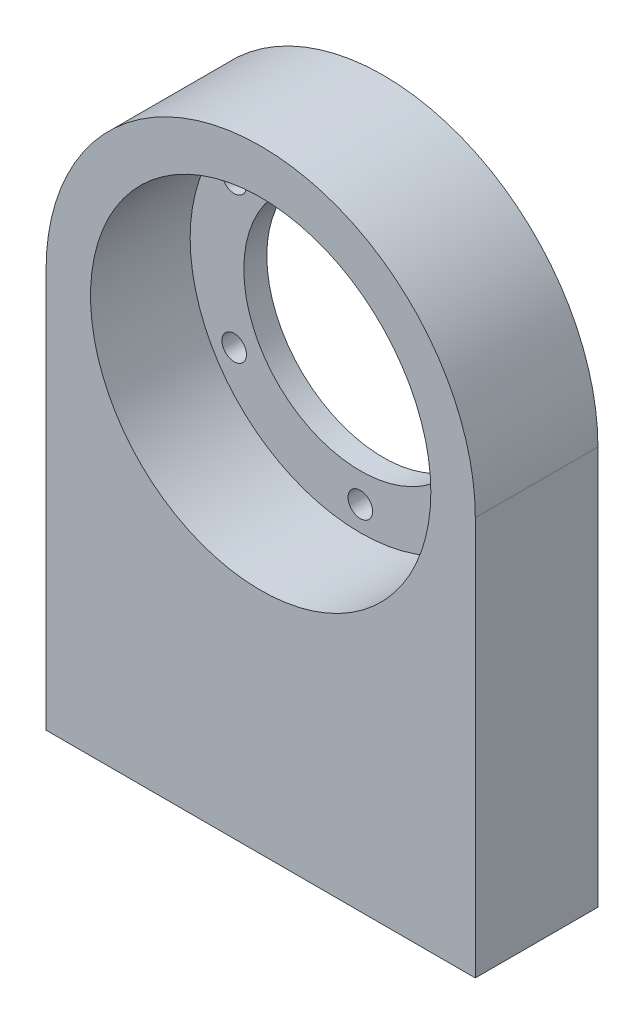
ISO-10303-21;
HEADER;
FILE_DESCRIPTION(('STEP AP214'),'2;1');
FILE_NAME('part.step','',(''),(''),'','','');
FILE_SCHEMA(('AUTOMOTIVE_DESIGN { 1 0 10303 214 1 1 1 1 }'));
ENDSEC;
DATA;
#1=APPLICATION_CONTEXT('core data for automotive mechanical design processes');
#2=APPLICATION_PROTOCOL_DEFINITION('international standard','automotive_design',2000,#1);
#3=PRODUCT_CONTEXT('',#1,'mechanical');
#4=PRODUCT('Part','Part','',(#3));
#5=PRODUCT_RELATED_PRODUCT_CATEGORY('part','',(#4));
#6=PRODUCT_DEFINITION_FORMATION('','',#4);
#7=PRODUCT_DEFINITION_CONTEXT('part definition',#1,'design');
#8=PRODUCT_DEFINITION('design','',#6,#7);
#9=PRODUCT_DEFINITION_SHAPE('','',#8);
#10=(LENGTH_UNIT() NAMED_UNIT(*) SI_UNIT(.MILLI.,.METRE.));
#11=(NAMED_UNIT(*) PLANE_ANGLE_UNIT() SI_UNIT($,.RADIAN.));
#12=(NAMED_UNIT(*) SI_UNIT($,.STERADIAN.) SOLID_ANGLE_UNIT());
#13=UNCERTAINTY_MEASURE_WITH_UNIT(LENGTH_MEASURE(1.E-05),#10,'distance_accuracy_value','');
#14=(GEOMETRIC_REPRESENTATION_CONTEXT(3) GLOBAL_UNCERTAINTY_ASSIGNED_CONTEXT((#13)) GLOBAL_UNIT_ASSIGNED_CONTEXT((#10,
#11,#12)) REPRESENTATION_CONTEXT('',''));
#15=CARTESIAN_POINT('',(0.,0.,0.));
#16=DIRECTION('',(0.,0.,1.));
#17=DIRECTION('',(1.,0.,0.));
#18=AXIS2_PLACEMENT_3D('',#15,#16,#17);
#19=CARTESIAN_POINT('',(0.,0.,8.));
#20=DIRECTION('',(0.,0.,-1.));
#21=DIRECTION('',(-1.,0.,0.));
#22=AXIS2_PLACEMENT_3D('',#19,#20,#21);
#23=PLANE('',#22);
#24=CARTESIAN_POINT('',(0.,0.,8.));
#25=DIRECTION('',(0.,0.,1.));
#26=DIRECTION('',(1.,0.,0.));
#27=AXIS2_PLACEMENT_3D('',#24,#25,#26);
#28=CIRCLE('',#27,11.1);
#29=CARTESIAN_POINT('',(11.1,0.,8.));
#30=VERTEX_POINT('',#29);
#31=EDGE_CURVE('E124',#30,#30,#28,.T.);
#32=ORIENTED_EDGE('',*,*,#31,.F.);
#33=EDGE_LOOP('',(#32));
#34=FACE_BOUND('',#33,.T.);
#35=CARTESIAN_POINT('',(0.,0.,8.));
#36=DIRECTION('',(0.,0.,1.));
#37=DIRECTION('',(-1.,0.,0.));
#38=AXIS2_PLACEMENT_3D('',#35,#36,#37);
#39=CIRCLE('',#38,14.);
#40=CARTESIAN_POINT('',(14.,0.,8.));
#41=VERTEX_POINT('',#40);
#42=CARTESIAN_POINT('',(-14.,0.,8.));
#43=VERTEX_POINT('',#42);
#44=EDGE_CURVE('E91',#41,#43,#39,.T.);
#45=ORIENTED_EDGE('',*,*,#44,.T.);
#46=DIRECTION('',(0.,-1.,0.));
#47=VECTOR('',#46,1.);
#48=CARTESIAN_POINT('',(-14.,0.,8.));
#49=LINE('',#48,#47);
#50=CARTESIAN_POINT('',(-14.,-26.,8.));
#51=VERTEX_POINT('',#50);
#52=EDGE_CURVE('E87',#43,#51,#49,.T.);
#53=ORIENTED_EDGE('',*,*,#52,.T.);
#54=DIRECTION('',(1.,0.,0.));
#55=VECTOR('',#54,1.);
#56=CARTESIAN_POINT('',(-14.,-26.,8.));
#57=LINE('',#56,#55);
#58=CARTESIAN_POINT('',(14.,-26.,8.));
#59=VERTEX_POINT('',#58);
#60=EDGE_CURVE('E89',#51,#59,#57,.T.);
#61=ORIENTED_EDGE('',*,*,#60,.T.);
#62=DIRECTION('',(0.,1.,0.));
#63=VECTOR('',#62,1.);
#64=CARTESIAN_POINT('',(14.,0.,8.));
#65=LINE('',#64,#63);
#66=EDGE_CURVE('E57',#59,#41,#65,.T.);
#67=ORIENTED_EDGE('',*,*,#66,.T.);
#68=EDGE_LOOP('',(#45,#53,#61,#67));
#69=FACE_BOUND('',#68,.T.);
#70=ADVANCED_FACE('F39',(#34,#69),#23,.F.);
#71=CARTESIAN_POINT('',(0.,0.,0.));
#72=DIRECTION('',(0.,0.,-1.));
#73=DIRECTION('',(-1.,0.,0.));
#74=AXIS2_PLACEMENT_3D('',#71,#72,#73);
#75=PLANE('',#74);
#76=CARTESIAN_POINT('',(0.,9.5,0.));
#77=DIRECTION('',(0.,0.,-1.));
#78=DIRECTION('',(-1.,0.,0.));
#79=AXIS2_PLACEMENT_3D('',#76,#77,#78);
#80=CIRCLE('',#79,0.8);
#81=CARTESIAN_POINT('',(-0.8,9.5,0.));
#82=VERTEX_POINT('',#81);
#83=EDGE_CURVE('E151',#82,#82,#80,.T.);
#84=ORIENTED_EDGE('',*,*,#83,.F.);
#85=EDGE_LOOP('',(#84));
#86=FACE_BOUND('',#85,.T.);
#87=CARTESIAN_POINT('',(8.22724133595217,4.74999999999999,0.));
#88=DIRECTION('',(0.,0.,-1.));
#89=DIRECTION('',(-1.,0.,0.));
#90=AXIS2_PLACEMENT_3D('',#87,#88,#89);
#91=CIRCLE('',#90,0.800000000000113);
#92=CARTESIAN_POINT('',(7.42724133595206,4.74999999999999,0.));
#93=VERTEX_POINT('',#92);
#94=EDGE_CURVE('E135',#93,#93,#91,.T.);
#95=ORIENTED_EDGE('',*,*,#94,.F.);
#96=EDGE_LOOP('',(#95));
#97=FACE_BOUND('',#96,.T.);
#98=CARTESIAN_POINT('',(8.22724133595217,-4.75,0.));
#99=DIRECTION('',(0.,0.,-1.));
#100=DIRECTION('',(-1.,0.,0.));
#101=AXIS2_PLACEMENT_3D('',#98,#99,#100);
#102=CIRCLE('',#101,0.800000000000088);
#103=CARTESIAN_POINT('',(7.42724133595208,-4.75,0.));
#104=VERTEX_POINT('',#103);
#105=EDGE_CURVE('E128',#104,#104,#102,.T.);
#106=ORIENTED_EDGE('',*,*,#105,.F.);
#107=EDGE_LOOP('',(#106));
#108=FACE_BOUND('',#107,.T.);
#109=CARTESIAN_POINT('',(0.,-9.5,0.));
#110=DIRECTION('',(0.,0.,-1.));
#111=DIRECTION('',(-1.,0.,0.));
#112=AXIS2_PLACEMENT_3D('',#109,#110,#111);
#113=CIRCLE('',#112,0.800000000000065);
#114=CARTESIAN_POINT('',(-0.800000000000066,-9.5,0.));
#115=VERTEX_POINT('',#114);
#116=EDGE_CURVE('E136',#115,#115,#113,.T.);
#117=ORIENTED_EDGE('',*,*,#116,.F.);
#118=EDGE_LOOP('',(#117));
#119=FACE_BOUND('',#118,.T.);
#120=CARTESIAN_POINT('',(-8.22724133595217,-4.75,0.));
#121=DIRECTION('',(0.,0.,-1.));
#122=DIRECTION('',(-1.,0.,0.));
#123=AXIS2_PLACEMENT_3D('',#120,#121,#122);
#124=CIRCLE('',#123,0.800000000000046);
#125=CARTESIAN_POINT('',(-9.02724133595221,-4.75,0.));
#126=VERTEX_POINT('',#125);
#127=EDGE_CURVE('E142',#126,#126,#124,.T.);
#128=ORIENTED_EDGE('',*,*,#127,.F.);
#129=EDGE_LOOP('',(#128));
#130=FACE_BOUND('',#129,.T.);
#131=CARTESIAN_POINT('',(-8.22724133595217,4.75,0.));
#132=DIRECTION('',(0.,0.,-1.));
#133=DIRECTION('',(-1.,0.,0.));
#134=AXIS2_PLACEMENT_3D('',#131,#132,#133);
#135=CIRCLE('',#134,0.800000000000025);
#136=CARTESIAN_POINT('',(-9.02724133595219,4.75,0.));
#137=VERTEX_POINT('',#136);
#138=EDGE_CURVE('E148',#137,#137,#135,.T.);
#139=ORIENTED_EDGE('',*,*,#138,.F.);
#140=EDGE_LOOP('',(#139));
#141=FACE_BOUND('',#140,.T.);
#142=CARTESIAN_POINT('',(0.,0.,0.));
#143=DIRECTION('',(0.,0.,1.));
#144=DIRECTION('',(-1.,0.,0.));
#145=AXIS2_PLACEMENT_3D('',#142,#143,#144);
#146=CIRCLE('',#145,14.);
#147=CARTESIAN_POINT('',(14.,0.,0.));
#148=VERTEX_POINT('',#147);
#149=CARTESIAN_POINT('',(-14.,0.,0.));
#150=VERTEX_POINT('',#149);
#151=EDGE_CURVE('E104',#148,#150,#146,.T.);
#152=ORIENTED_EDGE('',*,*,#151,.F.);
#153=DIRECTION('',(0.,1.,0.));
#154=VECTOR('',#153,1.);
#155=CARTESIAN_POINT('',(14.,0.,0.));
#156=LINE('',#155,#154);
#157=CARTESIAN_POINT('',(14.,-26.,0.));
#158=VERTEX_POINT('',#157);
#159=EDGE_CURVE('E80',#158,#148,#156,.T.);
#160=ORIENTED_EDGE('',*,*,#159,.F.);
#161=DIRECTION('',(1.,0.,0.));
#162=VECTOR('',#161,1.);
#163=CARTESIAN_POINT('',(-14.,-26.,0.));
#164=LINE('',#163,#162);
#165=CARTESIAN_POINT('',(-14.,-26.,0.));
#166=VERTEX_POINT('',#165);
#167=EDGE_CURVE('E74',#166,#158,#164,.T.);
#168=ORIENTED_EDGE('',*,*,#167,.F.);
#169=DIRECTION('',(0.,-1.,0.));
#170=VECTOR('',#169,1.);
#171=CARTESIAN_POINT('',(-14.,0.,0.));
#172=LINE('',#171,#170);
#173=EDGE_CURVE('E95',#150,#166,#172,.T.);
#174=ORIENTED_EDGE('',*,*,#173,.F.);
#175=EDGE_LOOP('',(#152,#160,#168,#174));
#176=FACE_BOUND('',#175,.T.);
#177=CARTESIAN_POINT('',(0.,0.,0.));
#178=DIRECTION('',(0.,0.,1.));
#179=DIRECTION('',(1.,0.,0.));
#180=AXIS2_PLACEMENT_3D('',#177,#178,#179);
#181=CIRCLE('',#180,7.6);
#182=CARTESIAN_POINT('',(7.6,0.,0.));
#183=VERTEX_POINT('',#182);
#184=EDGE_CURVE('E107',#183,#183,#181,.T.);
#185=ORIENTED_EDGE('',*,*,#184,.T.);
#186=EDGE_LOOP('',(#185));
#187=FACE_BOUND('',#186,.T.);
#188=ADVANCED_FACE('F115',(#86,#97,#108,#119,#130,#141,#176,#187),#75,.T.);
#189=CARTESIAN_POINT('',(0.,0.,8.));
#190=DIRECTION('',(0.,0.,-1.));
#191=DIRECTION('',(-1.,0.,0.));
#192=AXIS2_PLACEMENT_3D('',#189,#190,#191);
#193=CYLINDRICAL_SURFACE('',#192,14.);
#194=ORIENTED_EDGE('',*,*,#151,.T.);
#195=DIRECTION('',(0.,0.,-1.));
#196=VECTOR('',#195,1.);
#197=CARTESIAN_POINT('',(-14.,0.,8.));
#198=LINE('',#197,#196);
#199=EDGE_CURVE('E12',#43,#150,#198,.T.);
#200=ORIENTED_EDGE('',*,*,#199,.F.);
#201=ORIENTED_EDGE('',*,*,#44,.F.);
#202=DIRECTION('',(0.,0.,-1.));
#203=VECTOR('',#202,1.);
#204=CARTESIAN_POINT('',(14.,0.,8.));
#205=LINE('',#204,#203);
#206=EDGE_CURVE('E100',#41,#148,#205,.T.);
#207=ORIENTED_EDGE('',*,*,#206,.T.);
#208=EDGE_LOOP('',(#194,#200,#201,#207));
#209=FACE_BOUND('',#208,.T.);
#210=ADVANCED_FACE('F41',(#209),#193,.T.);
#211=CARTESIAN_POINT('',(-14.,0.,8.));
#212=DIRECTION('',(1.,0.,0.));
#213=DIRECTION('',(0.,1.,0.));
#214=AXIS2_PLACEMENT_3D('',#211,#212,#213);
#215=PLANE('',#214);
#216=ORIENTED_EDGE('',*,*,#173,.T.);
#217=DIRECTION('',(0.,0.,-1.));
#218=VECTOR('',#217,1.);
#219=CARTESIAN_POINT('',(-14.,-26.,8.));
#220=LINE('',#219,#218);
#221=EDGE_CURVE('E49',#51,#166,#220,.T.);
#222=ORIENTED_EDGE('',*,*,#221,.F.);
#223=ORIENTED_EDGE('',*,*,#52,.F.);
#224=ORIENTED_EDGE('',*,*,#199,.T.);
#225=EDGE_LOOP('',(#216,#222,#223,#224));
#226=FACE_BOUND('',#225,.T.);
#227=ADVANCED_FACE('F94',(#226),#215,.F.);
#228=CARTESIAN_POINT('',(-14.,-26.,8.));
#229=DIRECTION('',(0.,1.,0.));
#230=DIRECTION('',(0.,0.,1.));
#231=AXIS2_PLACEMENT_3D('',#228,#229,#230);
#232=PLANE('',#231);
#233=CARTESIAN_POINT('',(-10.,-26.,4.));
#234=DIRECTION('',(0.,-1.,0.));
#235=DIRECTION('',(0.,0.,-1.));
#236=AXIS2_PLACEMENT_3D('',#233,#234,#235);
#237=CIRCLE('',#236,1.5);
#238=CARTESIAN_POINT('',(-10.,-26.,2.5));
#239=VERTEX_POINT('',#238);
#240=EDGE_CURVE('E170',#239,#239,#237,.T.);
#241=ORIENTED_EDGE('',*,*,#240,.F.);
#242=EDGE_LOOP('',(#241));
#243=FACE_BOUND('',#242,.T.);
#244=CARTESIAN_POINT('',(10.,-26.,4.));
#245=DIRECTION('',(0.,-1.,0.));
#246=DIRECTION('',(0.,0.,-1.));
#247=AXIS2_PLACEMENT_3D('',#244,#245,#246);
#248=CIRCLE('',#247,1.5);
#249=CARTESIAN_POINT('',(10.,-26.,2.5));
#250=VERTEX_POINT('',#249);
#251=EDGE_CURVE('E167',#250,#250,#248,.T.);
#252=ORIENTED_EDGE('',*,*,#251,.F.);
#253=EDGE_LOOP('',(#252));
#254=FACE_BOUND('',#253,.T.);
#255=ORIENTED_EDGE('',*,*,#167,.T.);
#256=DIRECTION('',(0.,0.,-1.));
#257=VECTOR('',#256,1.);
#258=CARTESIAN_POINT('',(14.,-26.,8.));
#259=LINE('',#258,#257);
#260=EDGE_CURVE('E96',#59,#158,#259,.T.);
#261=ORIENTED_EDGE('',*,*,#260,.F.);
#262=ORIENTED_EDGE('',*,*,#60,.F.);
#263=ORIENTED_EDGE('',*,*,#221,.T.);
#264=EDGE_LOOP('',(#255,#261,#262,#263));
#265=FACE_BOUND('',#264,.T.);
#266=ADVANCED_FACE('F98',(#243,#254,#265),#232,.F.);
#267=CARTESIAN_POINT('',(14.,0.,8.));
#268=DIRECTION('',(-1.,0.,0.));
#269=DIRECTION('',(0.,-1.,0.));
#270=AXIS2_PLACEMENT_3D('',#267,#268,#269);
#271=PLANE('',#270);
#272=ORIENTED_EDGE('',*,*,#159,.T.);
#273=ORIENTED_EDGE('',*,*,#206,.F.);
#274=ORIENTED_EDGE('',*,*,#66,.F.);
#275=ORIENTED_EDGE('',*,*,#260,.T.);
#276=EDGE_LOOP('',(#272,#273,#274,#275));
#277=FACE_BOUND('',#276,.T.);
#278=ADVANCED_FACE('F112',(#277),#271,.F.);
#279=CARTESIAN_POINT('',(0.,0.,8.));
#280=DIRECTION('',(0.,0.,-1.));
#281=DIRECTION('',(-1.,0.,0.));
#282=AXIS2_PLACEMENT_3D('',#279,#280,#281);
#283=CYLINDRICAL_SURFACE('',#282,7.6);
#284=CARTESIAN_POINT('',(0.,0.,1.5));
#285=DIRECTION('',(0.,0.,-1.));
#286=DIRECTION('',(-1.,0.,0.));
#287=AXIS2_PLACEMENT_3D('',#284,#285,#286);
#288=CIRCLE('',#287,7.6);
#289=CARTESIAN_POINT('',(-7.6,0.,1.5));
#290=VERTEX_POINT('',#289);
#291=EDGE_CURVE('E43',#290,#290,#288,.T.);
#292=ORIENTED_EDGE('',*,*,#291,.F.);
#293=EDGE_LOOP('',(#292));
#294=FACE_BOUND('',#293,.T.);
#295=ORIENTED_EDGE('',*,*,#184,.F.);
#296=EDGE_LOOP('',(#295));
#297=FACE_BOUND('',#296,.T.);
#298=ADVANCED_FACE('F215',(#294,#297),#283,.F.);
#299=CARTESIAN_POINT('',(0.,0.,1.5));
#300=DIRECTION('',(0.,0.,-1.));
#301=DIRECTION('',(-1.,0.,0.));
#302=AXIS2_PLACEMENT_3D('',#299,#300,#301);
#303=PLANE('',#302);
#304=CARTESIAN_POINT('',(0.,9.5,1.5));
#305=DIRECTION('',(0.,0.,-1.));
#306=DIRECTION('',(-1.,0.,0.));
#307=AXIS2_PLACEMENT_3D('',#304,#305,#306);
#308=CIRCLE('',#307,0.8);
#309=CARTESIAN_POINT('',(-0.8,9.5,1.5));
#310=VERTEX_POINT('',#309);
#311=EDGE_CURVE('E127',#310,#310,#308,.F.);
#312=ORIENTED_EDGE('',*,*,#311,.F.);
#313=EDGE_LOOP('',(#312));
#314=FACE_BOUND('',#313,.T.);
#315=CARTESIAN_POINT('',(8.22724133595217,4.74999999999999,1.5));
#316=DIRECTION('',(0.,0.,-1.));
#317=DIRECTION('',(-1.,0.,0.));
#318=AXIS2_PLACEMENT_3D('',#315,#316,#317);
#319=CIRCLE('',#318,0.800000000000113);
#320=CARTESIAN_POINT('',(7.42724133595206,4.74999999999999,1.5));
#321=VERTEX_POINT('',#320);
#322=EDGE_CURVE('E156',#321,#321,#319,.F.);
#323=ORIENTED_EDGE('',*,*,#322,.F.);
#324=EDGE_LOOP('',(#323));
#325=FACE_BOUND('',#324,.T.);
#326=CARTESIAN_POINT('',(8.22724133595217,-4.75,1.5));
#327=DIRECTION('',(0.,0.,-1.));
#328=DIRECTION('',(-1.,0.,0.));
#329=AXIS2_PLACEMENT_3D('',#326,#327,#328);
#330=CIRCLE('',#329,0.800000000000088);
#331=CARTESIAN_POINT('',(7.42724133595208,-4.75,1.5));
#332=VERTEX_POINT('',#331);
#333=EDGE_CURVE('E132',#332,#332,#330,.F.);
#334=ORIENTED_EDGE('',*,*,#333,.F.);
#335=EDGE_LOOP('',(#334));
#336=FACE_BOUND('',#335,.T.);
#337=CARTESIAN_POINT('',(0.,-9.5,1.5));
#338=DIRECTION('',(0.,0.,-1.));
#339=DIRECTION('',(-1.,0.,0.));
#340=AXIS2_PLACEMENT_3D('',#337,#338,#339);
#341=CIRCLE('',#340,0.800000000000065);
#342=CARTESIAN_POINT('',(-0.800000000000066,-9.5,1.5));
#343=VERTEX_POINT('',#342);
#344=EDGE_CURVE('E131',#343,#343,#341,.F.);
#345=ORIENTED_EDGE('',*,*,#344,.F.);
#346=EDGE_LOOP('',(#345));
#347=FACE_BOUND('',#346,.T.);
#348=CARTESIAN_POINT('',(-8.22724133595217,-4.75,1.5));
#349=DIRECTION('',(0.,0.,-1.));
#350=DIRECTION('',(-1.,0.,0.));
#351=AXIS2_PLACEMENT_3D('',#348,#349,#350);
#352=CIRCLE('',#351,0.800000000000046);
#353=CARTESIAN_POINT('',(-9.02724133595221,-4.75,1.5));
#354=VERTEX_POINT('',#353);
#355=EDGE_CURVE('E139',#354,#354,#352,.F.);
#356=ORIENTED_EDGE('',*,*,#355,.F.);
#357=EDGE_LOOP('',(#356));
#358=FACE_BOUND('',#357,.T.);
#359=CARTESIAN_POINT('',(-8.22724133595217,4.75,1.5));
#360=DIRECTION('',(0.,0.,-1.));
#361=DIRECTION('',(-1.,0.,0.));
#362=AXIS2_PLACEMENT_3D('',#359,#360,#361);
#363=CIRCLE('',#362,0.800000000000025);
#364=CARTESIAN_POINT('',(-9.02724133595219,4.75,1.5));
#365=VERTEX_POINT('',#364);
#366=EDGE_CURVE('E145',#365,#365,#363,.F.);
#367=ORIENTED_EDGE('',*,*,#366,.F.);
#368=EDGE_LOOP('',(#367));
#369=FACE_BOUND('',#368,.T.);
#370=ORIENTED_EDGE('',*,*,#291,.T.);
#371=EDGE_LOOP('',(#370));
#372=FACE_BOUND('',#371,.T.);
#373=CARTESIAN_POINT('',(0.,0.,1.5));
#374=DIRECTION('',(0.,0.,-1.));
#375=DIRECTION('',(-1.,0.,0.));
#376=AXIS2_PLACEMENT_3D('',#373,#374,#375);
#377=CIRCLE('',#376,11.1);
#378=CARTESIAN_POINT('',(-11.1,0.,1.5));
#379=VERTEX_POINT('',#378);
#380=EDGE_CURVE('E121',#379,#379,#377,.F.);
#381=ORIENTED_EDGE('',*,*,#380,.T.);
#382=EDGE_LOOP('',(#381));
#383=FACE_BOUND('',#382,.T.);
#384=ADVANCED_FACE('F242',(#314,#325,#336,#347,#358,#369,#372,#383),#303,.F.);
#385=CARTESIAN_POINT('',(0.,0.,-31.3955410846827));
#386=DIRECTION('',(0.,0.,1.));
#387=DIRECTION('',(1.,0.,0.));
#388=AXIS2_PLACEMENT_3D('',#385,#386,#387);
#389=CYLINDRICAL_SURFACE('',#388,11.1);
#390=ORIENTED_EDGE('',*,*,#31,.T.);
#391=EDGE_LOOP('',(#390));
#392=FACE_BOUND('',#391,.T.);
#393=ORIENTED_EDGE('',*,*,#380,.F.);
#394=EDGE_LOOP('',(#393));
#395=FACE_BOUND('',#394,.T.);
#396=ADVANCED_FACE('F237',(#392,#395),#389,.F.);
#397=CARTESIAN_POINT('',(-8.22724133595217,4.75,8.001));
#398=DIRECTION('',(0.,0.,-1.));
#399=DIRECTION('',(-1.,0.,0.));
#400=AXIS2_PLACEMENT_3D('',#397,#398,#399);
#401=CYLINDRICAL_SURFACE('',#400,0.800000000000025);
#402=ORIENTED_EDGE('',*,*,#138,.T.);
#403=EDGE_LOOP('',(#402));
#404=FACE_BOUND('',#403,.T.);
#405=ORIENTED_EDGE('',*,*,#366,.T.);
#406=EDGE_LOOP('',(#405));
#407=FACE_BOUND('',#406,.T.);
#408=ADVANCED_FACE('F254',(#404,#407),#401,.F.);
#409=CARTESIAN_POINT('',(-8.22724133595217,-4.75,8.001));
#410=DIRECTION('',(0.,0.,-1.));
#411=DIRECTION('',(-1.,0.,0.));
#412=AXIS2_PLACEMENT_3D('',#409,#410,#411);
#413=CYLINDRICAL_SURFACE('',#412,0.800000000000046);
#414=ORIENTED_EDGE('',*,*,#127,.T.);
#415=EDGE_LOOP('',(#414));
#416=FACE_BOUND('',#415,.T.);
#417=ORIENTED_EDGE('',*,*,#355,.T.);
#418=EDGE_LOOP('',(#417));
#419=FACE_BOUND('',#418,.T.);
#420=ADVANCED_FACE('F259',(#416,#419),#413,.F.);
#421=CARTESIAN_POINT('',(0.,-9.5,8.001));
#422=DIRECTION('',(0.,0.,-1.));
#423=DIRECTION('',(-1.,0.,0.));
#424=AXIS2_PLACEMENT_3D('',#421,#422,#423);
#425=CYLINDRICAL_SURFACE('',#424,0.800000000000065);
#426=ORIENTED_EDGE('',*,*,#116,.T.);
#427=EDGE_LOOP('',(#426));
#428=FACE_BOUND('',#427,.T.);
#429=ORIENTED_EDGE('',*,*,#344,.T.);
#430=EDGE_LOOP('',(#429));
#431=FACE_BOUND('',#430,.T.);
#432=ADVANCED_FACE('F270',(#428,#431),#425,.F.);
#433=CARTESIAN_POINT('',(8.22724133595217,-4.75,8.001));
#434=DIRECTION('',(0.,0.,-1.));
#435=DIRECTION('',(-1.,0.,0.));
#436=AXIS2_PLACEMENT_3D('',#433,#434,#435);
#437=CYLINDRICAL_SURFACE('',#436,0.800000000000088);
#438=ORIENTED_EDGE('',*,*,#105,.T.);
#439=EDGE_LOOP('',(#438));
#440=FACE_BOUND('',#439,.T.);
#441=ORIENTED_EDGE('',*,*,#333,.T.);
#442=EDGE_LOOP('',(#441));
#443=FACE_BOUND('',#442,.T.);
#444=ADVANCED_FACE('F281',(#440,#443),#437,.F.);
#445=CARTESIAN_POINT('',(8.22724133595217,4.74999999999999,8.001));
#446=DIRECTION('',(0.,0.,-1.));
#447=DIRECTION('',(-1.,0.,0.));
#448=AXIS2_PLACEMENT_3D('',#445,#446,#447);
#449=CYLINDRICAL_SURFACE('',#448,0.800000000000113);
#450=ORIENTED_EDGE('',*,*,#94,.T.);
#451=EDGE_LOOP('',(#450));
#452=FACE_BOUND('',#451,.T.);
#453=ORIENTED_EDGE('',*,*,#322,.T.);
#454=EDGE_LOOP('',(#453));
#455=FACE_BOUND('',#454,.T.);
#456=ADVANCED_FACE('F201',(#452,#455),#449,.F.);
#457=CARTESIAN_POINT('',(0.,9.5,8.001));
#458=DIRECTION('',(0.,0.,-1.));
#459=DIRECTION('',(-1.,0.,0.));
#460=AXIS2_PLACEMENT_3D('',#457,#458,#459);
#461=CYLINDRICAL_SURFACE('',#460,0.8);
#462=ORIENTED_EDGE('',*,*,#83,.T.);
#463=EDGE_LOOP('',(#462));
#464=FACE_BOUND('',#463,.T.);
#465=ORIENTED_EDGE('',*,*,#311,.T.);
#466=EDGE_LOOP('',(#465));
#467=FACE_BOUND('',#466,.T.);
#468=ADVANCED_FACE('F192',(#464,#467),#461,.F.);
#469=CARTESIAN_POINT('',(10.,-11.,4.));
#470=DIRECTION('',(0.,-1.,0.));
#471=DIRECTION('',(0.,0.,-1.));
#472=AXIS2_PLACEMENT_3D('',#469,#470,#471);
#473=CYLINDRICAL_SURFACE('',#472,1.5);
#474=CARTESIAN_POINT('',(10.,-11.,4.));
#475=DIRECTION('',(0.,-1.,0.));
#476=DIRECTION('',(0.,0.,-1.));
#477=AXIS2_PLACEMENT_3D('',#474,#475,#476);
#478=CIRCLE('',#477,1.5);
#479=CARTESIAN_POINT('',(10.,-11.,2.5));
#480=VERTEX_POINT('',#479);
#481=EDGE_CURVE('E164',#480,#480,#478,.T.);
#482=ORIENTED_EDGE('',*,*,#481,.F.);
#483=EDGE_LOOP('',(#482));
#484=FACE_BOUND('',#483,.T.);
#485=ORIENTED_EDGE('',*,*,#251,.T.);
#486=EDGE_LOOP('',(#485));
#487=FACE_BOUND('',#486,.T.);
#488=ADVANCED_FACE('F190',(#484,#487),#473,.F.);
#489=CARTESIAN_POINT('',(10.,-11.,4.));
#490=DIRECTION('',(0.,-1.,0.));
#491=DIRECTION('',(0.,0.,-1.));
#492=AXIS2_PLACEMENT_3D('',#489,#490,#491);
#493=PLANE('',#492);
#494=ORIENTED_EDGE('',*,*,#481,.T.);
#495=EDGE_LOOP('',(#494));
#496=FACE_BOUND('',#495,.T.);
#497=ADVANCED_FACE('F181',(#496),#493,.T.);
#498=CARTESIAN_POINT('',(-10.,-11.,4.));
#499=DIRECTION('',(0.,-1.,0.));
#500=DIRECTION('',(0.,0.,-1.));
#501=AXIS2_PLACEMENT_3D('',#498,#499,#500);
#502=CYLINDRICAL_SURFACE('',#501,1.5);
#503=CARTESIAN_POINT('',(-10.,-11.,4.));
#504=DIRECTION('',(0.,-1.,0.));
#505=DIRECTION('',(0.,0.,-1.));
#506=AXIS2_PLACEMENT_3D('',#503,#504,#505);
#507=CIRCLE('',#506,1.5);
#508=CARTESIAN_POINT('',(-10.,-11.,2.5));
#509=VERTEX_POINT('',#508);
#510=EDGE_CURVE('E159',#509,#509,#507,.T.);
#511=ORIENTED_EDGE('',*,*,#510,.F.);
#512=EDGE_LOOP('',(#511));
#513=FACE_BOUND('',#512,.T.);
#514=ORIENTED_EDGE('',*,*,#240,.T.);
#515=EDGE_LOOP('',(#514));
#516=FACE_BOUND('',#515,.T.);
#517=ADVANCED_FACE('F178',(#513,#516),#502,.F.);
#518=CARTESIAN_POINT('',(-10.,-11.,4.));
#519=DIRECTION('',(0.,-1.,0.));
#520=DIRECTION('',(0.,0.,-1.));
#521=AXIS2_PLACEMENT_3D('',#518,#519,#520);
#522=PLANE('',#521);
#523=ORIENTED_EDGE('',*,*,#510,.T.);
#524=EDGE_LOOP('',(#523));
#525=FACE_BOUND('',#524,.T.);
#526=ADVANCED_FACE('F176',(#525),#522,.T.);
#527=CLOSED_SHELL('',(#70,#188,#210,#227,#266,#278,#298,#384,#396,#408,#420,#432,#444,#456,#468,
#488,#497,#517,#526));
#528=MANIFOLD_SOLID_BREP('B2',#527);
#529=ADVANCED_BREP_SHAPE_REPRESENTATION('',(#18,#528),#14);
#530=SHAPE_DEFINITION_REPRESENTATION(#9,#529);
ENDSEC;
END-ISO-10303-21;
